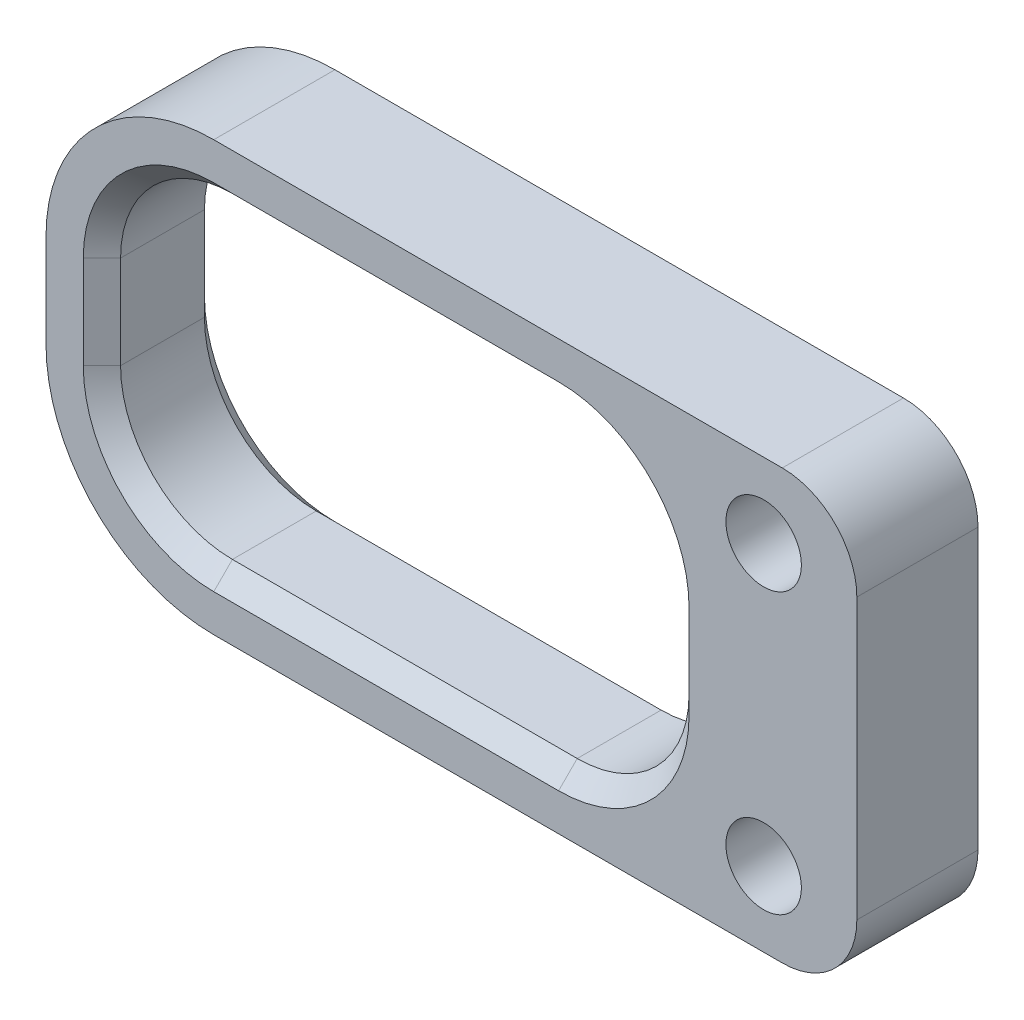
ISO-10303-21;
HEADER;
FILE_DESCRIPTION(('STEP AP214'),'2;1');
FILE_NAME('part.step','',(''),(''),'','','');
FILE_SCHEMA(('AUTOMOTIVE_DESIGN { 1 0 10303 214 1 1 1 1 }'));
ENDSEC;
DATA;
#1=APPLICATION_CONTEXT('core data for automotive mechanical design processes');
#2=APPLICATION_PROTOCOL_DEFINITION('international standard','automotive_design',2000,#1);
#3=PRODUCT_CONTEXT('',#1,'mechanical');
#4=PRODUCT('Part','Part','',(#3));
#5=PRODUCT_RELATED_PRODUCT_CATEGORY('part','',(#4));
#6=PRODUCT_DEFINITION_FORMATION('','',#4);
#7=PRODUCT_DEFINITION_CONTEXT('part definition',#1,'design');
#8=PRODUCT_DEFINITION('design','',#6,#7);
#9=PRODUCT_DEFINITION_SHAPE('','',#8);
#10=(LENGTH_UNIT() NAMED_UNIT(*) SI_UNIT(.MILLI.,.METRE.));
#11=(NAMED_UNIT(*) PLANE_ANGLE_UNIT() SI_UNIT($,.RADIAN.));
#12=(NAMED_UNIT(*) SI_UNIT($,.STERADIAN.) SOLID_ANGLE_UNIT());
#13=UNCERTAINTY_MEASURE_WITH_UNIT(LENGTH_MEASURE(1.E-05),#10,'distance_accuracy_value','');
#14=(GEOMETRIC_REPRESENTATION_CONTEXT(3) GLOBAL_UNCERTAINTY_ASSIGNED_CONTEXT((#13)) GLOBAL_UNIT_ASSIGNED_CONTEXT((#10,
#11,#12)) REPRESENTATION_CONTEXT('',''));
#15=CARTESIAN_POINT('',(0.,0.,0.));
#16=DIRECTION('',(0.,0.,1.));
#17=DIRECTION('',(1.,0.,0.));
#18=AXIS2_PLACEMENT_3D('',#15,#16,#17);
#19=CARTESIAN_POINT('',(-29.5,-5.,6.5));
#20=DIRECTION('',(0.,0.,1.));
#21=DIRECTION('',(1.,0.,0.));
#22=AXIS2_PLACEMENT_3D('',#19,#20,#21);
#23=PLANE('',#22);
#24=CARTESIAN_POINT('',(-11.,-10.,6.5));
#25=DIRECTION('',(0.,0.,1.));
#26=DIRECTION('',(1.,0.,0.));
#27=AXIS2_PLACEMENT_3D('',#24,#25,#26);
#28=CIRCLE('',#27,6.99999999999999);
#29=CARTESIAN_POINT('',(-4.,-10.,6.5));
#30=VERTEX_POINT('',#29);
#31=CARTESIAN_POINT('',(-11.,-17.,6.5));
#32=VERTEX_POINT('',#31);
#33=EDGE_CURVE('E41',#30,#32,#28,.F.);
#34=ORIENTED_EDGE('',*,*,#33,.T.);
#35=DIRECTION('',(-1.,0.,0.));
#36=VECTOR('',#35,1.);
#37=CARTESIAN_POINT('',(-29.5,-17.,6.5));
#38=LINE('',#37,#36);
#39=CARTESIAN_POINT('',(-29.5,-17.,6.5));
#40=VERTEX_POINT('',#39);
#41=EDGE_CURVE('E11',#32,#40,#38,.T.);
#42=ORIENTED_EDGE('',*,*,#41,.T.);
#43=CARTESIAN_POINT('',(-29.5,-10.,6.5));
#44=DIRECTION('',(0.,0.,1.));
#45=DIRECTION('',(1.,0.,0.));
#46=AXIS2_PLACEMENT_3D('',#43,#44,#45);
#47=CIRCLE('',#46,6.99999999999999);
#48=CARTESIAN_POINT('',(-36.5,-10.,6.5));
#49=VERTEX_POINT('',#48);
#50=EDGE_CURVE('E286',#40,#49,#47,.F.);
#51=ORIENTED_EDGE('',*,*,#50,.T.);
#52=DIRECTION('',(0.,1.,0.));
#53=VECTOR('',#52,1.);
#54=CARTESIAN_POINT('',(-36.5,-5.,6.5));
#55=LINE('',#54,#53);
#56=CARTESIAN_POINT('',(-36.5,-5.,6.5));
#57=VERTEX_POINT('',#56);
#58=EDGE_CURVE('E282',#49,#57,#55,.T.);
#59=ORIENTED_EDGE('',*,*,#58,.T.);
#60=CARTESIAN_POINT('',(-29.5,-5.,6.5));
#61=DIRECTION('',(0.,0.,1.));
#62=DIRECTION('',(1.,0.,0.));
#63=AXIS2_PLACEMENT_3D('',#60,#61,#62);
#64=CIRCLE('',#63,6.99999999999999);
#65=CARTESIAN_POINT('',(-29.5,1.99999999999999,6.5));
#66=VERTEX_POINT('',#65);
#67=EDGE_CURVE('E278',#57,#66,#64,.F.);
#68=ORIENTED_EDGE('',*,*,#67,.T.);
#69=DIRECTION('',(1.,0.,0.));
#70=VECTOR('',#69,1.);
#71=CARTESIAN_POINT('',(-29.5,1.99999999999999,6.5));
#72=LINE('',#71,#70);
#73=CARTESIAN_POINT('',(-11.,1.99999999999999,6.5));
#74=VERTEX_POINT('',#73);
#75=EDGE_CURVE('E276',#66,#74,#72,.T.);
#76=ORIENTED_EDGE('',*,*,#75,.T.);
#77=CARTESIAN_POINT('',(-11.,-5.,6.5));
#78=DIRECTION('',(0.,0.,1.));
#79=DIRECTION('',(1.,0.,0.));
#80=AXIS2_PLACEMENT_3D('',#77,#78,#79);
#81=CIRCLE('',#80,6.99999999999999);
#82=CARTESIAN_POINT('',(-4.00000000000001,-5.,6.5));
#83=VERTEX_POINT('',#82);
#84=EDGE_CURVE('E280',#74,#83,#81,.F.);
#85=ORIENTED_EDGE('',*,*,#84,.T.);
#86=DIRECTION('',(0.,-1.,0.));
#87=VECTOR('',#86,1.);
#88=CARTESIAN_POINT('',(-4.,-5.,6.5));
#89=LINE('',#88,#87);
#90=EDGE_CURVE('E284',#83,#30,#89,.T.);
#91=ORIENTED_EDGE('',*,*,#90,.T.);
#92=EDGE_LOOP('',(#34,#42,#51,#59,#68,#76,#85,#91));
#93=FACE_BOUND('',#92,.T.);
#94=CARTESIAN_POINT('',(0.,-15.,6.5));
#95=DIRECTION('',(0.,0.,1.));
#96=DIRECTION('',(1.,0.,0.));
#97=AXIS2_PLACEMENT_3D('',#94,#95,#96);
#98=CIRCLE('',#97,2.02548347896413);
#99=CARTESIAN_POINT('',(2.02548347896413,-15.,6.5));
#100=VERTEX_POINT('',#99);
#101=EDGE_CURVE('E383',#100,#100,#98,.T.);
#102=ORIENTED_EDGE('',*,*,#101,.F.);
#103=EDGE_LOOP('',(#102));
#104=FACE_BOUND('',#103,.T.);
#105=CARTESIAN_POINT('',(-29.5,-5.,6.5));
#106=DIRECTION('',(0.,0.,1.));
#107=DIRECTION('',(1.,0.,0.));
#108=AXIS2_PLACEMENT_3D('',#105,#106,#107);
#109=CIRCLE('',#108,9.);
#110=CARTESIAN_POINT('',(-29.5,4.,6.5));
#111=VERTEX_POINT('',#110);
#112=CARTESIAN_POINT('',(-38.5,-5.,6.5));
#113=VERTEX_POINT('',#112);
#114=EDGE_CURVE('E206',#111,#113,#109,.T.);
#115=ORIENTED_EDGE('',*,*,#114,.T.);
#116=DIRECTION('',(0.,-1.,0.));
#117=VECTOR('',#116,1.);
#118=CARTESIAN_POINT('',(-38.5,-5.,6.5));
#119=LINE('',#118,#117);
#120=CARTESIAN_POINT('',(-38.5,-10.,6.5));
#121=VERTEX_POINT('',#120);
#122=EDGE_CURVE('E195',#113,#121,#119,.T.);
#123=ORIENTED_EDGE('',*,*,#122,.T.);
#124=CARTESIAN_POINT('',(-29.5,-10.,6.5));
#125=DIRECTION('',(0.,0.,1.));
#126=DIRECTION('',(1.,0.,0.));
#127=AXIS2_PLACEMENT_3D('',#124,#125,#126);
#128=CIRCLE('',#127,9.);
#129=CARTESIAN_POINT('',(-29.5,-19.,6.5));
#130=VERTEX_POINT('',#129);
#131=EDGE_CURVE('E205',#121,#130,#128,.T.);
#132=ORIENTED_EDGE('',*,*,#131,.T.);
#133=DIRECTION('',(1.,0.,0.));
#134=VECTOR('',#133,1.);
#135=CARTESIAN_POINT('',(-29.5,-19.,6.5));
#136=LINE('',#135,#134);
#137=CARTESIAN_POINT('',(1.,-19.,6.5));
#138=VERTEX_POINT('',#137);
#139=EDGE_CURVE('E395',#130,#138,#136,.T.);
#140=ORIENTED_EDGE('',*,*,#139,.T.);
#141=CARTESIAN_POINT('',(1.,-15.,6.5));
#142=DIRECTION('',(0.,0.,1.));
#143=DIRECTION('',(1.,0.,0.));
#144=AXIS2_PLACEMENT_3D('',#141,#142,#143);
#145=CIRCLE('',#144,4.);
#146=CARTESIAN_POINT('',(5.,-15.,6.5));
#147=VERTEX_POINT('',#146);
#148=EDGE_CURVE('E397',#138,#147,#145,.T.);
#149=ORIENTED_EDGE('',*,*,#148,.T.);
#150=DIRECTION('',(0.,1.,0.));
#151=VECTOR('',#150,1.);
#152=CARTESIAN_POINT('',(5.,0.,6.5));
#153=LINE('',#152,#151);
#154=CARTESIAN_POINT('',(5.,0.,6.5));
#155=VERTEX_POINT('',#154);
#156=EDGE_CURVE('E399',#147,#155,#153,.T.);
#157=ORIENTED_EDGE('',*,*,#156,.T.);
#158=CARTESIAN_POINT('',(1.,0.,6.5));
#159=DIRECTION('',(0.,0.,1.));
#160=DIRECTION('',(-1.,0.,0.));
#161=AXIS2_PLACEMENT_3D('',#158,#159,#160);
#162=CIRCLE('',#161,4.);
#163=CARTESIAN_POINT('',(1.,4.,6.5));
#164=VERTEX_POINT('',#163);
#165=EDGE_CURVE('E401',#155,#164,#162,.T.);
#166=ORIENTED_EDGE('',*,*,#165,.T.);
#167=DIRECTION('',(-1.,0.,0.));
#168=VECTOR('',#167,1.);
#169=CARTESIAN_POINT('',(-29.5,4.,6.5));
#170=LINE('',#169,#168);
#171=EDGE_CURVE('E211',#164,#111,#170,.T.);
#172=ORIENTED_EDGE('',*,*,#171,.T.);
#173=EDGE_LOOP('',(#115,#123,#132,#140,#149,#157,#166,#172));
#174=FACE_BOUND('',#173,.T.);
#175=CARTESIAN_POINT('',(0.,0.,6.5));
#176=DIRECTION('',(0.,0.,1.));
#177=DIRECTION('',(1.,0.,0.));
#178=AXIS2_PLACEMENT_3D('',#175,#176,#177);
#179=CIRCLE('',#178,2.02548347896413);
#180=CARTESIAN_POINT('',(2.02548347896413,0.,6.5));
#181=VERTEX_POINT('',#180);
#182=EDGE_CURVE('E389',#181,#181,#179,.T.);
#183=ORIENTED_EDGE('',*,*,#182,.F.);
#184=EDGE_LOOP('',(#183));
#185=FACE_BOUND('',#184,.T.);
#186=ADVANCED_FACE('F32',(#93,#104,#174,#185),#23,.T.);
#187=CARTESIAN_POINT('',(-29.5,-5.,0.));
#188=DIRECTION('',(0.,0.,1.));
#189=DIRECTION('',(1.,0.,0.));
#190=AXIS2_PLACEMENT_3D('',#187,#188,#189);
#191=PLANE('',#190);
#192=CARTESIAN_POINT('',(-11.,-5.,0.));
#193=DIRECTION('',(0.,0.,1.));
#194=DIRECTION('',(1.,0.,0.));
#195=AXIS2_PLACEMENT_3D('',#192,#193,#194);
#196=CIRCLE('',#195,7.);
#197=CARTESIAN_POINT('',(-4.,-5.,0.));
#198=VERTEX_POINT('',#197);
#199=CARTESIAN_POINT('',(-11.,2.,0.));
#200=VERTEX_POINT('',#199);
#201=EDGE_CURVE('E235',#198,#200,#196,.T.);
#202=ORIENTED_EDGE('',*,*,#201,.T.);
#203=DIRECTION('',(-1.,0.,0.));
#204=VECTOR('',#203,1.);
#205=CARTESIAN_POINT('',(-29.5,2.,0.));
#206=LINE('',#205,#204);
#207=CARTESIAN_POINT('',(-29.5,2.,0.));
#208=VERTEX_POINT('',#207);
#209=EDGE_CURVE('E239',#200,#208,#206,.T.);
#210=ORIENTED_EDGE('',*,*,#209,.T.);
#211=CARTESIAN_POINT('',(-29.5,-5.,0.));
#212=DIRECTION('',(0.,0.,1.));
#213=DIRECTION('',(1.,0.,0.));
#214=AXIS2_PLACEMENT_3D('',#211,#212,#213);
#215=CIRCLE('',#214,7.);
#216=CARTESIAN_POINT('',(-36.5,-5.,0.));
#217=VERTEX_POINT('',#216);
#218=EDGE_CURVE('E237',#208,#217,#215,.T.);
#219=ORIENTED_EDGE('',*,*,#218,.T.);
#220=DIRECTION('',(0.,-1.,0.));
#221=VECTOR('',#220,1.);
#222=CARTESIAN_POINT('',(-36.5,-10.,0.));
#223=LINE('',#222,#221);
#224=CARTESIAN_POINT('',(-36.5,-10.,0.));
#225=VERTEX_POINT('',#224);
#226=EDGE_CURVE('E233',#217,#225,#223,.T.);
#227=ORIENTED_EDGE('',*,*,#226,.T.);
#228=CARTESIAN_POINT('',(-29.5,-10.,0.));
#229=DIRECTION('',(0.,0.,1.));
#230=DIRECTION('',(1.,0.,0.));
#231=AXIS2_PLACEMENT_3D('',#228,#229,#230);
#232=CIRCLE('',#231,7.);
#233=CARTESIAN_POINT('',(-29.5,-17.,0.));
#234=VERTEX_POINT('',#233);
#235=EDGE_CURVE('E229',#225,#234,#232,.T.);
#236=ORIENTED_EDGE('',*,*,#235,.T.);
#237=DIRECTION('',(1.,0.,0.));
#238=VECTOR('',#237,1.);
#239=CARTESIAN_POINT('',(-11.,-17.,0.));
#240=LINE('',#239,#238);
#241=CARTESIAN_POINT('',(-11.,-17.,0.));
#242=VERTEX_POINT('',#241);
#243=EDGE_CURVE('E220',#234,#242,#240,.T.);
#244=ORIENTED_EDGE('',*,*,#243,.T.);
#245=CARTESIAN_POINT('',(-11.,-10.,0.));
#246=DIRECTION('',(0.,0.,1.));
#247=DIRECTION('',(1.,0.,0.));
#248=AXIS2_PLACEMENT_3D('',#245,#246,#247);
#249=CIRCLE('',#248,7.);
#250=CARTESIAN_POINT('',(-4.,-10.,0.));
#251=VERTEX_POINT('',#250);
#252=EDGE_CURVE('E222',#242,#251,#249,.T.);
#253=ORIENTED_EDGE('',*,*,#252,.T.);
#254=DIRECTION('',(0.,1.,0.));
#255=VECTOR('',#254,1.);
#256=CARTESIAN_POINT('',(-4.,-5.,0.));
#257=LINE('',#256,#255);
#258=EDGE_CURVE('E231',#251,#198,#257,.T.);
#259=ORIENTED_EDGE('',*,*,#258,.T.);
#260=EDGE_LOOP('',(#202,#210,#219,#227,#236,#244,#253,#259));
#261=FACE_BOUND('',#260,.T.);
#262=CARTESIAN_POINT('',(0.,-15.,0.));
#263=DIRECTION('',(0.,0.,1.));
#264=DIRECTION('',(1.,0.,0.));
#265=AXIS2_PLACEMENT_3D('',#262,#263,#264);
#266=CIRCLE('',#265,2.02548347896413);
#267=CARTESIAN_POINT('',(2.02548347896413,-15.,0.));
#268=VERTEX_POINT('',#267);
#269=EDGE_CURVE('E382',#268,#268,#266,.T.);
#270=ORIENTED_EDGE('',*,*,#269,.T.);
#271=EDGE_LOOP('',(#270));
#272=FACE_BOUND('',#271,.T.);
#273=CARTESIAN_POINT('',(-29.5,-5.,0.));
#274=DIRECTION('',(0.,0.,1.));
#275=DIRECTION('',(1.,0.,0.));
#276=AXIS2_PLACEMENT_3D('',#273,#274,#275);
#277=CIRCLE('',#276,9.);
#278=CARTESIAN_POINT('',(-29.5,4.,0.));
#279=VERTEX_POINT('',#278);
#280=CARTESIAN_POINT('',(-38.5,-5.,0.));
#281=VERTEX_POINT('',#280);
#282=EDGE_CURVE('E219',#279,#281,#277,.T.);
#283=ORIENTED_EDGE('',*,*,#282,.F.);
#284=DIRECTION('',(-1.,0.,0.));
#285=VECTOR('',#284,1.);
#286=CARTESIAN_POINT('',(-29.5,4.,0.));
#287=LINE('',#286,#285);
#288=CARTESIAN_POINT('',(1.,4.,0.));
#289=VERTEX_POINT('',#288);
#290=EDGE_CURVE('E215',#289,#279,#287,.T.);
#291=ORIENTED_EDGE('',*,*,#290,.F.);
#292=CARTESIAN_POINT('',(1.,0.,0.));
#293=DIRECTION('',(0.,0.,1.));
#294=DIRECTION('',(-1.,0.,0.));
#295=AXIS2_PLACEMENT_3D('',#292,#293,#294);
#296=CIRCLE('',#295,4.);
#297=CARTESIAN_POINT('',(5.,0.,0.));
#298=VERTEX_POINT('',#297);
#299=EDGE_CURVE('E416',#298,#289,#296,.T.);
#300=ORIENTED_EDGE('',*,*,#299,.F.);
#301=DIRECTION('',(0.,1.,0.));
#302=VECTOR('',#301,1.);
#303=CARTESIAN_POINT('',(5.,0.,0.));
#304=LINE('',#303,#302);
#305=CARTESIAN_POINT('',(5.,-15.,0.));
#306=VERTEX_POINT('',#305);
#307=EDGE_CURVE('E414',#306,#298,#304,.T.);
#308=ORIENTED_EDGE('',*,*,#307,.F.);
#309=CARTESIAN_POINT('',(1.,-15.,0.));
#310=DIRECTION('',(0.,0.,1.));
#311=DIRECTION('',(1.,0.,0.));
#312=AXIS2_PLACEMENT_3D('',#309,#310,#311);
#313=CIRCLE('',#312,4.);
#314=CARTESIAN_POINT('',(1.,-19.,0.));
#315=VERTEX_POINT('',#314);
#316=EDGE_CURVE('E412',#315,#306,#313,.T.);
#317=ORIENTED_EDGE('',*,*,#316,.F.);
#318=DIRECTION('',(1.,0.,0.));
#319=VECTOR('',#318,1.);
#320=CARTESIAN_POINT('',(-29.5,-19.,0.));
#321=LINE('',#320,#319);
#322=CARTESIAN_POINT('',(-29.5,-19.,0.));
#323=VERTEX_POINT('',#322);
#324=EDGE_CURVE('E410',#323,#315,#321,.T.);
#325=ORIENTED_EDGE('',*,*,#324,.F.);
#326=CARTESIAN_POINT('',(-29.5,-10.,0.));
#327=DIRECTION('',(0.,0.,1.));
#328=DIRECTION('',(1.,0.,0.));
#329=AXIS2_PLACEMENT_3D('',#326,#327,#328);
#330=CIRCLE('',#329,9.);
#331=CARTESIAN_POINT('',(-38.5,-10.,0.));
#332=VERTEX_POINT('',#331);
#333=EDGE_CURVE('E408',#332,#323,#330,.T.);
#334=ORIENTED_EDGE('',*,*,#333,.F.);
#335=DIRECTION('',(0.,-1.,0.));
#336=VECTOR('',#335,1.);
#337=CARTESIAN_POINT('',(-38.5,-5.,0.));
#338=LINE('',#337,#336);
#339=EDGE_CURVE('E406',#281,#332,#338,.T.);
#340=ORIENTED_EDGE('',*,*,#339,.F.);
#341=EDGE_LOOP('',(#283,#291,#300,#308,#317,#325,#334,#340));
#342=FACE_BOUND('',#341,.T.);
#343=CARTESIAN_POINT('',(0.,0.,0.));
#344=DIRECTION('',(0.,0.,1.));
#345=DIRECTION('',(1.,0.,0.));
#346=AXIS2_PLACEMENT_3D('',#343,#344,#345);
#347=CIRCLE('',#346,2.02548347896413);
#348=CARTESIAN_POINT('',(2.02548347896413,0.,0.));
#349=VERTEX_POINT('',#348);
#350=EDGE_CURVE('E386',#349,#349,#347,.T.);
#351=ORIENTED_EDGE('',*,*,#350,.T.);
#352=EDGE_LOOP('',(#351));
#353=FACE_BOUND('',#352,.T.);
#354=ADVANCED_FACE('F442',(#261,#272,#342,#353),#191,.F.);
#355=CARTESIAN_POINT('',(-29.5,-5.,6.5));
#356=DIRECTION('',(0.,0.,-1.));
#357=DIRECTION('',(-1.,0.,0.));
#358=AXIS2_PLACEMENT_3D('',#355,#356,#357);
#359=CYLINDRICAL_SURFACE('',#358,9.);
#360=ORIENTED_EDGE('',*,*,#282,.T.);
#361=DIRECTION('',(0.,0.,-1.));
#362=VECTOR('',#361,1.);
#363=CARTESIAN_POINT('',(-38.5,-5.,6.5));
#364=LINE('',#363,#362);
#365=EDGE_CURVE('E199',#113,#281,#364,.T.);
#366=ORIENTED_EDGE('',*,*,#365,.F.);
#367=ORIENTED_EDGE('',*,*,#114,.F.);
#368=DIRECTION('',(0.,0.,-1.));
#369=VECTOR('',#368,1.);
#370=CARTESIAN_POINT('',(-29.5,4.,6.5));
#371=LINE('',#370,#369);
#372=EDGE_CURVE('E404',#111,#279,#371,.T.);
#373=ORIENTED_EDGE('',*,*,#372,.T.);
#374=EDGE_LOOP('',(#360,#366,#367,#373));
#375=FACE_BOUND('',#374,.T.);
#376=ADVANCED_FACE('F217',(#375),#359,.T.);
#377=CARTESIAN_POINT('',(-38.5,-5.,6.5));
#378=DIRECTION('',(1.,0.,0.));
#379=DIRECTION('',(0.,0.,-1.));
#380=AXIS2_PLACEMENT_3D('',#377,#378,#379);
#381=PLANE('',#380);
#382=ORIENTED_EDGE('',*,*,#339,.T.);
#383=DIRECTION('',(0.,0.,-1.));
#384=VECTOR('',#383,1.);
#385=CARTESIAN_POINT('',(-38.5,-10.,6.5));
#386=LINE('',#385,#384);
#387=EDGE_CURVE('E202',#121,#332,#386,.T.);
#388=ORIENTED_EDGE('',*,*,#387,.F.);
#389=ORIENTED_EDGE('',*,*,#122,.F.);
#390=ORIENTED_EDGE('',*,*,#365,.T.);
#391=EDGE_LOOP('',(#382,#388,#389,#390));
#392=FACE_BOUND('',#391,.T.);
#393=ADVANCED_FACE('F197',(#392),#381,.F.);
#394=CARTESIAN_POINT('',(-29.5,-10.,6.5));
#395=DIRECTION('',(0.,0.,-1.));
#396=DIRECTION('',(-1.,0.,0.));
#397=AXIS2_PLACEMENT_3D('',#394,#395,#396);
#398=CYLINDRICAL_SURFACE('',#397,9.);
#399=ORIENTED_EDGE('',*,*,#333,.T.);
#400=DIRECTION('',(0.,0.,-1.));
#401=VECTOR('',#400,1.);
#402=CARTESIAN_POINT('',(-29.5,-19.,6.5));
#403=LINE('',#402,#401);
#404=EDGE_CURVE('E224',#130,#323,#403,.T.);
#405=ORIENTED_EDGE('',*,*,#404,.F.);
#406=ORIENTED_EDGE('',*,*,#131,.F.);
#407=ORIENTED_EDGE('',*,*,#387,.T.);
#408=EDGE_LOOP('',(#399,#405,#406,#407));
#409=FACE_BOUND('',#408,.T.);
#410=ADVANCED_FACE('F456',(#409),#398,.T.);
#411=CARTESIAN_POINT('',(-29.5,-19.,6.5));
#412=DIRECTION('',(0.,1.,0.));
#413=DIRECTION('',(0.,0.,1.));
#414=AXIS2_PLACEMENT_3D('',#411,#412,#413);
#415=PLANE('',#414);
#416=ORIENTED_EDGE('',*,*,#324,.T.);
#417=DIRECTION('',(0.,0.,-1.));
#418=VECTOR('',#417,1.);
#419=CARTESIAN_POINT('',(1.,-19.,6.5));
#420=LINE('',#419,#418);
#421=EDGE_CURVE('E429',#138,#315,#420,.T.);
#422=ORIENTED_EDGE('',*,*,#421,.F.);
#423=ORIENTED_EDGE('',*,*,#139,.F.);
#424=ORIENTED_EDGE('',*,*,#404,.T.);
#425=EDGE_LOOP('',(#416,#422,#423,#424));
#426=FACE_BOUND('',#425,.T.);
#427=ADVANCED_FACE('F436',(#426),#415,.F.);
#428=CARTESIAN_POINT('',(1.,-15.,6.5));
#429=DIRECTION('',(0.,0.,-1.));
#430=DIRECTION('',(-1.,0.,0.));
#431=AXIS2_PLACEMENT_3D('',#428,#429,#430);
#432=CYLINDRICAL_SURFACE('',#431,4.);
#433=ORIENTED_EDGE('',*,*,#316,.T.);
#434=DIRECTION('',(0.,0.,-1.));
#435=VECTOR('',#434,1.);
#436=CARTESIAN_POINT('',(5.,-15.,6.5));
#437=LINE('',#436,#435);
#438=EDGE_CURVE('E426',#147,#306,#437,.T.);
#439=ORIENTED_EDGE('',*,*,#438,.F.);
#440=ORIENTED_EDGE('',*,*,#148,.F.);
#441=ORIENTED_EDGE('',*,*,#421,.T.);
#442=EDGE_LOOP('',(#433,#439,#440,#441));
#443=FACE_BOUND('',#442,.T.);
#444=ADVANCED_FACE('F448',(#443),#432,.T.);
#445=CARTESIAN_POINT('',(5.,0.,6.5));
#446=DIRECTION('',(-1.,0.,0.));
#447=DIRECTION('',(0.,0.,1.));
#448=AXIS2_PLACEMENT_3D('',#445,#446,#447);
#449=PLANE('',#448);
#450=ORIENTED_EDGE('',*,*,#307,.T.);
#451=DIRECTION('',(0.,0.,-1.));
#452=VECTOR('',#451,1.);
#453=CARTESIAN_POINT('',(5.,0.,6.5));
#454=LINE('',#453,#452);
#455=EDGE_CURVE('E423',#155,#298,#454,.T.);
#456=ORIENTED_EDGE('',*,*,#455,.F.);
#457=ORIENTED_EDGE('',*,*,#156,.F.);
#458=ORIENTED_EDGE('',*,*,#438,.T.);
#459=EDGE_LOOP('',(#450,#456,#457,#458));
#460=FACE_BOUND('',#459,.T.);
#461=ADVANCED_FACE('F452',(#460),#449,.F.);
#462=CARTESIAN_POINT('',(1.,0.,6.5));
#463=DIRECTION('',(0.,0.,-1.));
#464=DIRECTION('',(-1.,0.,0.));
#465=AXIS2_PLACEMENT_3D('',#462,#463,#464);
#466=CYLINDRICAL_SURFACE('',#465,4.);
#467=ORIENTED_EDGE('',*,*,#299,.T.);
#468=DIRECTION('',(0.,0.,-1.));
#469=VECTOR('',#468,1.);
#470=CARTESIAN_POINT('',(1.,4.,6.5));
#471=LINE('',#470,#469);
#472=EDGE_CURVE('E420',#164,#289,#471,.T.);
#473=ORIENTED_EDGE('',*,*,#472,.F.);
#474=ORIENTED_EDGE('',*,*,#165,.F.);
#475=ORIENTED_EDGE('',*,*,#455,.T.);
#476=EDGE_LOOP('',(#467,#473,#474,#475));
#477=FACE_BOUND('',#476,.T.);
#478=ADVANCED_FACE('F479',(#477),#466,.T.);
#479=CARTESIAN_POINT('',(-29.5,4.,6.5));
#480=DIRECTION('',(0.,-1.,0.));
#481=DIRECTION('',(0.,0.,-1.));
#482=AXIS2_PLACEMENT_3D('',#479,#480,#481);
#483=PLANE('',#482);
#484=ORIENTED_EDGE('',*,*,#290,.T.);
#485=ORIENTED_EDGE('',*,*,#372,.F.);
#486=ORIENTED_EDGE('',*,*,#171,.F.);
#487=ORIENTED_EDGE('',*,*,#472,.T.);
#488=EDGE_LOOP('',(#484,#485,#486,#487));
#489=FACE_BOUND('',#488,.T.);
#490=ADVANCED_FACE('F476',(#489),#483,.F.);
#491=CARTESIAN_POINT('',(0.,0.,6.5));
#492=DIRECTION('',(0.,0.,-1.));
#493=DIRECTION('',(-1.,0.,0.));
#494=AXIS2_PLACEMENT_3D('',#491,#492,#493);
#495=CYLINDRICAL_SURFACE('',#494,2.02548347896413);
#496=ORIENTED_EDGE('',*,*,#182,.T.);
#497=EDGE_LOOP('',(#496));
#498=FACE_BOUND('',#497,.T.);
#499=ORIENTED_EDGE('',*,*,#350,.F.);
#500=EDGE_LOOP('',(#499));
#501=FACE_BOUND('',#500,.T.);
#502=ADVANCED_FACE('F473',(#498,#501),#495,.F.);
#503=CARTESIAN_POINT('',(0.,-15.,6.5));
#504=DIRECTION('',(0.,0.,-1.));
#505=DIRECTION('',(-1.,0.,0.));
#506=AXIS2_PLACEMENT_3D('',#503,#504,#505);
#507=CYLINDRICAL_SURFACE('',#506,2.02548347896413);
#508=ORIENTED_EDGE('',*,*,#101,.T.);
#509=EDGE_LOOP('',(#508));
#510=FACE_BOUND('',#509,.T.);
#511=ORIENTED_EDGE('',*,*,#269,.F.);
#512=EDGE_LOOP('',(#511));
#513=FACE_BOUND('',#512,.T.);
#514=ADVANCED_FACE('F509',(#510,#513),#507,.F.);
#515=CARTESIAN_POINT('',(-11.,-5.,6.5));
#516=DIRECTION('',(0.,0.,-1.));
#517=DIRECTION('',(-1.,0.,0.));
#518=AXIS2_PLACEMENT_3D('',#515,#516,#517);
#519=CYLINDRICAL_SURFACE('',#518,6.);
#520=DIRECTION('',(0.,0.,-1.));
#521=VECTOR('',#520,1.);
#522=CARTESIAN_POINT('',(-11.,1.,6.5));
#523=LINE('',#522,#521);
#524=CARTESIAN_POINT('',(-11.,1.,5.50000000000001));
#525=VERTEX_POINT('',#524);
#526=CARTESIAN_POINT('',(-11.,1.,1.00000000000001));
#527=VERTEX_POINT('',#526);
#528=EDGE_CURVE('E379',#525,#527,#523,.T.);
#529=ORIENTED_EDGE('',*,*,#528,.T.);
#530=CARTESIAN_POINT('',(-11.,-5.,1.00000000000001));
#531=DIRECTION('',(0.,0.,1.));
#532=DIRECTION('',(1.,0.,0.));
#533=AXIS2_PLACEMENT_3D('',#530,#531,#532);
#534=CIRCLE('',#533,6.);
#535=CARTESIAN_POINT('',(-5.,-5.,1.00000000000001));
#536=VERTEX_POINT('',#535);
#537=EDGE_CURVE('E253',#527,#536,#534,.F.);
#538=ORIENTED_EDGE('',*,*,#537,.T.);
#539=DIRECTION('',(0.,0.,-1.));
#540=VECTOR('',#539,1.);
#541=CARTESIAN_POINT('',(-5.,-5.,6.5));
#542=LINE('',#541,#540);
#543=CARTESIAN_POINT('',(-5.,-5.,5.50000000000001));
#544=VERTEX_POINT('',#543);
#545=EDGE_CURVE('E311',#544,#536,#542,.T.);
#546=ORIENTED_EDGE('',*,*,#545,.F.);
#547=CARTESIAN_POINT('',(-11.,-5.,5.50000000000001));
#548=DIRECTION('',(0.,0.,1.));
#549=DIRECTION('',(1.,0.,0.));
#550=AXIS2_PLACEMENT_3D('',#547,#548,#549);
#551=CIRCLE('',#550,6.);
#552=EDGE_CURVE('E251',#544,#525,#551,.T.);
#553=ORIENTED_EDGE('',*,*,#552,.T.);
#554=EDGE_LOOP('',(#529,#538,#546,#553));
#555=FACE_BOUND('',#554,.T.);
#556=ADVANCED_FACE('F516',(#555),#519,.F.);
#557=CARTESIAN_POINT('',(-29.5,1.,6.5));
#558=DIRECTION('',(0.,-1.,0.));
#559=DIRECTION('',(0.,0.,-1.));
#560=AXIS2_PLACEMENT_3D('',#557,#558,#559);
#561=PLANE('',#560);
#562=DIRECTION('',(0.,0.,-1.));
#563=VECTOR('',#562,1.);
#564=CARTESIAN_POINT('',(-29.5,1.,6.5));
#565=LINE('',#564,#563);
#566=CARTESIAN_POINT('',(-29.5,1.,5.50000000000001));
#567=VERTEX_POINT('',#566);
#568=CARTESIAN_POINT('',(-29.5,1.,1.00000000000001));
#569=VERTEX_POINT('',#568);
#570=EDGE_CURVE('E376',#567,#569,#565,.T.);
#571=ORIENTED_EDGE('',*,*,#570,.T.);
#572=DIRECTION('',(1.,0.,0.));
#573=VECTOR('',#572,1.);
#574=CARTESIAN_POINT('',(-11.,1.,1.00000000000001));
#575=LINE('',#574,#573);
#576=EDGE_CURVE('E244',#569,#527,#575,.T.);
#577=ORIENTED_EDGE('',*,*,#576,.T.);
#578=ORIENTED_EDGE('',*,*,#528,.F.);
#579=DIRECTION('',(-1.,0.,0.));
#580=VECTOR('',#579,1.);
#581=CARTESIAN_POINT('',(-29.5,1.,5.50000000000001));
#582=LINE('',#581,#580);
#583=EDGE_CURVE('E242',#525,#567,#582,.T.);
#584=ORIENTED_EDGE('',*,*,#583,.T.);
#585=EDGE_LOOP('',(#571,#577,#578,#584));
#586=FACE_BOUND('',#585,.T.);
#587=ADVANCED_FACE('F523',(#586),#561,.T.);
#588=CARTESIAN_POINT('',(-29.5,-5.,6.5));
#589=DIRECTION('',(0.,0.,-1.));
#590=DIRECTION('',(-1.,0.,0.));
#591=AXIS2_PLACEMENT_3D('',#588,#589,#590);
#592=CYLINDRICAL_SURFACE('',#591,6.);
#593=DIRECTION('',(0.,0.,-1.));
#594=VECTOR('',#593,1.);
#595=CARTESIAN_POINT('',(-35.5,-5.,6.5));
#596=LINE('',#595,#594);
#597=CARTESIAN_POINT('',(-35.5,-5.,5.50000000000001));
#598=VERTEX_POINT('',#597);
#599=CARTESIAN_POINT('',(-35.5,-5.,1.00000000000001));
#600=VERTEX_POINT('',#599);
#601=EDGE_CURVE('E368',#598,#600,#596,.T.);
#602=ORIENTED_EDGE('',*,*,#601,.T.);
#603=CARTESIAN_POINT('',(-29.5,-5.,1.00000000000001));
#604=DIRECTION('',(0.,0.,1.));
#605=DIRECTION('',(1.,0.,0.));
#606=AXIS2_PLACEMENT_3D('',#603,#604,#605);
#607=CIRCLE('',#606,6.);
#608=EDGE_CURVE('E249',#600,#569,#607,.F.);
#609=ORIENTED_EDGE('',*,*,#608,.T.);
#610=ORIENTED_EDGE('',*,*,#570,.F.);
#611=CARTESIAN_POINT('',(-29.5,-5.,5.50000000000001));
#612=DIRECTION('',(0.,0.,1.));
#613=DIRECTION('',(1.,0.,0.));
#614=AXIS2_PLACEMENT_3D('',#611,#612,#613);
#615=CIRCLE('',#614,6.);
#616=EDGE_CURVE('E247',#567,#598,#615,.T.);
#617=ORIENTED_EDGE('',*,*,#616,.T.);
#618=EDGE_LOOP('',(#602,#609,#610,#617));
#619=FACE_BOUND('',#618,.T.);
#620=ADVANCED_FACE('F532',(#619),#592,.F.);
#621=CARTESIAN_POINT('',(-35.5,-5.,6.5));
#622=DIRECTION('',(1.,0.,0.));
#623=DIRECTION('',(0.,0.,-1.));
#624=AXIS2_PLACEMENT_3D('',#621,#622,#623);
#625=PLANE('',#624);
#626=DIRECTION('',(0.,0.,-1.));
#627=VECTOR('',#626,1.);
#628=CARTESIAN_POINT('',(-35.5,-10.,6.5));
#629=LINE('',#628,#627);
#630=CARTESIAN_POINT('',(-35.5,-10.,5.50000000000001));
#631=VERTEX_POINT('',#630);
#632=CARTESIAN_POINT('',(-35.5,-10.,1.00000000000001));
#633=VERTEX_POINT('',#632);
#634=EDGE_CURVE('E360',#631,#633,#629,.T.);
#635=ORIENTED_EDGE('',*,*,#634,.T.);
#636=DIRECTION('',(0.,1.,0.));
#637=VECTOR('',#636,1.);
#638=CARTESIAN_POINT('',(-35.5,-5.,1.00000000000001));
#639=LINE('',#638,#637);
#640=EDGE_CURVE('E257',#633,#600,#639,.T.);
#641=ORIENTED_EDGE('',*,*,#640,.T.);
#642=ORIENTED_EDGE('',*,*,#601,.F.);
#643=DIRECTION('',(0.,-1.,0.));
#644=VECTOR('',#643,1.);
#645=CARTESIAN_POINT('',(-35.5,-5.,5.50000000000001));
#646=LINE('',#645,#644);
#647=EDGE_CURVE('E255',#598,#631,#646,.T.);
#648=ORIENTED_EDGE('',*,*,#647,.T.);
#649=EDGE_LOOP('',(#635,#641,#642,#648));
#650=FACE_BOUND('',#649,.T.);
#651=ADVANCED_FACE('F540',(#650),#625,.T.);
#652=CARTESIAN_POINT('',(-29.5,-10.,6.5));
#653=DIRECTION('',(0.,0.,-1.));
#654=DIRECTION('',(-1.,0.,0.));
#655=AXIS2_PLACEMENT_3D('',#652,#653,#654);
#656=CYLINDRICAL_SURFACE('',#655,6.);
#657=DIRECTION('',(0.,0.,-1.));
#658=VECTOR('',#657,1.);
#659=CARTESIAN_POINT('',(-29.5,-16.,6.5));
#660=LINE('',#659,#658);
#661=CARTESIAN_POINT('',(-29.5,-16.,5.50000000000001));
#662=VERTEX_POINT('',#661);
#663=CARTESIAN_POINT('',(-29.5,-16.,1.00000000000001));
#664=VERTEX_POINT('',#663);
#665=EDGE_CURVE('E357',#662,#664,#660,.T.);
#666=ORIENTED_EDGE('',*,*,#665,.T.);
#667=CARTESIAN_POINT('',(-29.5,-10.,1.00000000000001));
#668=DIRECTION('',(0.,0.,1.));
#669=DIRECTION('',(1.,0.,0.));
#670=AXIS2_PLACEMENT_3D('',#667,#668,#669);
#671=CIRCLE('',#670,6.);
#672=EDGE_CURVE('E265',#664,#633,#671,.F.);
#673=ORIENTED_EDGE('',*,*,#672,.T.);
#674=ORIENTED_EDGE('',*,*,#634,.F.);
#675=CARTESIAN_POINT('',(-29.5,-10.,5.50000000000001));
#676=DIRECTION('',(0.,0.,1.));
#677=DIRECTION('',(1.,0.,0.));
#678=AXIS2_PLACEMENT_3D('',#675,#676,#677);
#679=CIRCLE('',#678,6.);
#680=EDGE_CURVE('E263',#631,#662,#679,.T.);
#681=ORIENTED_EDGE('',*,*,#680,.T.);
#682=EDGE_LOOP('',(#666,#673,#674,#681));
#683=FACE_BOUND('',#682,.T.);
#684=ADVANCED_FACE('F356',(#683),#656,.F.);
#685=CARTESIAN_POINT('',(-29.5,-16.,6.5));
#686=DIRECTION('',(0.,1.,0.));
#687=DIRECTION('',(0.,0.,1.));
#688=AXIS2_PLACEMENT_3D('',#685,#686,#687);
#689=PLANE('',#688);
#690=DIRECTION('',(0.,0.,-1.));
#691=VECTOR('',#690,1.);
#692=CARTESIAN_POINT('',(-11.,-16.,6.5));
#693=LINE('',#692,#691);
#694=CARTESIAN_POINT('',(-11.,-16.,5.50000000000001));
#695=VERTEX_POINT('',#694);
#696=CARTESIAN_POINT('',(-11.,-16.,1.00000000000001));
#697=VERTEX_POINT('',#696);
#698=EDGE_CURVE('E366',#695,#697,#693,.T.);
#699=ORIENTED_EDGE('',*,*,#698,.T.);
#700=DIRECTION('',(-1.,0.,0.));
#701=VECTOR('',#700,1.);
#702=CARTESIAN_POINT('',(-29.5,-16.,1.00000000000001));
#703=LINE('',#702,#701);
#704=EDGE_CURVE('E274',#697,#664,#703,.T.);
#705=ORIENTED_EDGE('',*,*,#704,.T.);
#706=ORIENTED_EDGE('',*,*,#665,.F.);
#707=DIRECTION('',(1.,0.,0.));
#708=VECTOR('',#707,1.);
#709=CARTESIAN_POINT('',(-29.5,-16.,5.50000000000001));
#710=LINE('',#709,#708);
#711=EDGE_CURVE('E271',#662,#695,#710,.T.);
#712=ORIENTED_EDGE('',*,*,#711,.T.);
#713=EDGE_LOOP('',(#699,#705,#706,#712));
#714=FACE_BOUND('',#713,.T.);
#715=ADVANCED_FACE('F363',(#714),#689,.T.);
#716=CARTESIAN_POINT('',(-11.,-10.,6.5));
#717=DIRECTION('',(0.,0.,-1.));
#718=DIRECTION('',(-1.,0.,0.));
#719=AXIS2_PLACEMENT_3D('',#716,#717,#718);
#720=CYLINDRICAL_SURFACE('',#719,6.);
#721=DIRECTION('',(0.,0.,-1.));
#722=VECTOR('',#721,1.);
#723=CARTESIAN_POINT('',(-5.,-10.,6.5));
#724=LINE('',#723,#722);
#725=CARTESIAN_POINT('',(-5.,-10.,5.50000000000001));
#726=VERTEX_POINT('',#725);
#727=CARTESIAN_POINT('',(-5.,-10.,1.00000000000001));
#728=VERTEX_POINT('',#727);
#729=EDGE_CURVE('E370',#726,#728,#724,.T.);
#730=ORIENTED_EDGE('',*,*,#729,.T.);
#731=CARTESIAN_POINT('',(-11.,-10.,1.00000000000001));
#732=DIRECTION('',(0.,0.,1.));
#733=DIRECTION('',(1.,0.,0.));
#734=AXIS2_PLACEMENT_3D('',#731,#732,#733);
#735=CIRCLE('',#734,6.);
#736=EDGE_CURVE('E269',#728,#697,#735,.F.);
#737=ORIENTED_EDGE('',*,*,#736,.T.);
#738=ORIENTED_EDGE('',*,*,#698,.F.);
#739=CARTESIAN_POINT('',(-11.,-10.,5.50000000000001));
#740=DIRECTION('',(0.,0.,1.));
#741=DIRECTION('',(1.,0.,0.));
#742=AXIS2_PLACEMENT_3D('',#739,#740,#741);
#743=CIRCLE('',#742,6.);
#744=EDGE_CURVE('E267',#695,#726,#743,.T.);
#745=ORIENTED_EDGE('',*,*,#744,.T.);
#746=EDGE_LOOP('',(#730,#737,#738,#745));
#747=FACE_BOUND('',#746,.T.);
#748=ADVANCED_FACE('F561',(#747),#720,.F.);
#749=CARTESIAN_POINT('',(-5.,-5.,6.5));
#750=DIRECTION('',(-1.,0.,0.));
#751=DIRECTION('',(0.,0.,1.));
#752=AXIS2_PLACEMENT_3D('',#749,#750,#751);
#753=PLANE('',#752);
#754=ORIENTED_EDGE('',*,*,#545,.T.);
#755=DIRECTION('',(0.,-1.,0.));
#756=VECTOR('',#755,1.);
#757=CARTESIAN_POINT('',(-5.,-10.,1.00000000000001));
#758=LINE('',#757,#756);
#759=EDGE_CURVE('E261',#536,#728,#758,.T.);
#760=ORIENTED_EDGE('',*,*,#759,.T.);
#761=ORIENTED_EDGE('',*,*,#729,.F.);
#762=DIRECTION('',(0.,1.,0.));
#763=VECTOR('',#762,1.);
#764=CARTESIAN_POINT('',(-5.,-5.,5.50000000000001));
#765=LINE('',#764,#763);
#766=EDGE_CURVE('E259',#726,#544,#765,.T.);
#767=ORIENTED_EDGE('',*,*,#766,.T.);
#768=EDGE_LOOP('',(#754,#760,#761,#767));
#769=FACE_BOUND('',#768,.T.);
#770=ADVANCED_FACE('F568',(#769),#753,.T.);
#771=CARTESIAN_POINT('',(-29.5,-17.,0.));
#772=DIRECTION('',(0.,0.70710678118655,-0.707106781186545));
#773=DIRECTION('',(0.,0.707106781186545,0.70710678118655));
#774=AXIS2_PLACEMENT_3D('',#771,#772,#773);
#775=PLANE('',#774);
#776=DIRECTION('',(0.,-0.707106781186545,-0.70710678118655));
#777=VECTOR('',#776,1.);
#778=CARTESIAN_POINT('',(-29.5,-16.,1.00000000000001));
#779=LINE('',#778,#777);
#780=EDGE_CURVE('E305',#664,#234,#779,.T.);
#781=ORIENTED_EDGE('',*,*,#780,.F.);
#782=ORIENTED_EDGE('',*,*,#704,.F.);
#783=DIRECTION('',(0.,0.707106781186545,0.70710678118655));
#784=VECTOR('',#783,1.);
#785=CARTESIAN_POINT('',(-11.,-17.,0.));
#786=LINE('',#785,#784);
#787=EDGE_CURVE('E308',#242,#697,#786,.T.);
#788=ORIENTED_EDGE('',*,*,#787,.F.);
#789=ORIENTED_EDGE('',*,*,#243,.F.);
#790=EDGE_LOOP('',(#781,#782,#788,#789));
#791=FACE_BOUND('',#790,.T.);
#792=ADVANCED_FACE('F576',(#791),#775,.T.);
#793=CARTESIAN_POINT('',(-11.,-10.,0.));
#794=DIRECTION('',(0.,0.,-1.));
#795=DIRECTION('',(-1.,0.,0.));
#796=AXIS2_PLACEMENT_3D('',#793,#794,#795);
#797=CONICAL_SURFACE('',#796,7.,0.785398163397445);
#798=ORIENTED_EDGE('',*,*,#787,.T.);
#799=ORIENTED_EDGE('',*,*,#736,.F.);
#800=DIRECTION('',(-0.707106781186545,0.,0.70710678118655));
#801=VECTOR('',#800,1.);
#802=CARTESIAN_POINT('',(-4.,-10.,0.));
#803=LINE('',#802,#801);
#804=EDGE_CURVE('E302',#251,#728,#803,.T.);
#805=ORIENTED_EDGE('',*,*,#804,.F.);
#806=ORIENTED_EDGE('',*,*,#252,.F.);
#807=EDGE_LOOP('',(#798,#799,#805,#806));
#808=FACE_BOUND('',#807,.T.);
#809=ADVANCED_FACE('F584',(#808),#797,.F.);
#810=CARTESIAN_POINT('',(-29.5,-10.,0.));
#811=DIRECTION('',(0.,0.,-1.));
#812=DIRECTION('',(-1.,0.,0.));
#813=AXIS2_PLACEMENT_3D('',#810,#811,#812);
#814=CONICAL_SURFACE('',#813,7.,0.785398163397445);
#815=ORIENTED_EDGE('',*,*,#780,.T.);
#816=ORIENTED_EDGE('',*,*,#235,.F.);
#817=DIRECTION('',(-0.707106781186545,0.,-0.70710678118655));
#818=VECTOR('',#817,1.);
#819=CARTESIAN_POINT('',(-35.5,-10.,1.00000000000001));
#820=LINE('',#819,#818);
#821=EDGE_CURVE('E299',#633,#225,#820,.T.);
#822=ORIENTED_EDGE('',*,*,#821,.F.);
#823=ORIENTED_EDGE('',*,*,#672,.F.);
#824=EDGE_LOOP('',(#815,#816,#822,#823));
#825=FACE_BOUND('',#824,.T.);
#826=ADVANCED_FACE('F592',(#825),#814,.F.);
#827=CARTESIAN_POINT('',(-4.,-5.,0.));
#828=DIRECTION('',(-0.707106781186549,0.,-0.707106781186546));
#829=DIRECTION('',(-0.707106781186546,0.,0.707106781186549));
#830=AXIS2_PLACEMENT_3D('',#827,#828,#829);
#831=PLANE('',#830);
#832=ORIENTED_EDGE('',*,*,#804,.T.);
#833=ORIENTED_EDGE('',*,*,#759,.F.);
#834=DIRECTION('',(-0.707106781186546,0.,0.707106781186549));
#835=VECTOR('',#834,1.);
#836=CARTESIAN_POINT('',(-4.,-5.,0.));
#837=LINE('',#836,#835);
#838=EDGE_CURVE('E296',#198,#536,#837,.T.);
#839=ORIENTED_EDGE('',*,*,#838,.F.);
#840=ORIENTED_EDGE('',*,*,#258,.F.);
#841=EDGE_LOOP('',(#832,#833,#839,#840));
#842=FACE_BOUND('',#841,.T.);
#843=ADVANCED_FACE('F600',(#842),#831,.T.);
#844=CARTESIAN_POINT('',(-36.5,-5.,0.));
#845=DIRECTION('',(0.70710678118655,0.,-0.707106781186545));
#846=DIRECTION('',(-0.707106781186545,0.,-0.70710678118655));
#847=AXIS2_PLACEMENT_3D('',#844,#845,#846);
#848=PLANE('',#847);
#849=ORIENTED_EDGE('',*,*,#821,.T.);
#850=ORIENTED_EDGE('',*,*,#226,.F.);
#851=DIRECTION('',(-0.707106781186545,0.,-0.70710678118655));
#852=VECTOR('',#851,1.);
#853=CARTESIAN_POINT('',(-35.5,-5.,1.00000000000001));
#854=LINE('',#853,#852);
#855=EDGE_CURVE('E293',#600,#217,#854,.T.);
#856=ORIENTED_EDGE('',*,*,#855,.F.);
#857=ORIENTED_EDGE('',*,*,#640,.F.);
#858=EDGE_LOOP('',(#849,#850,#856,#857));
#859=FACE_BOUND('',#858,.T.);
#860=ADVANCED_FACE('F608',(#859),#848,.T.);
#861=CARTESIAN_POINT('',(-11.,-5.,0.));
#862=DIRECTION('',(0.,0.,-1.));
#863=DIRECTION('',(-1.,0.,0.));
#864=AXIS2_PLACEMENT_3D('',#861,#862,#863);
#865=CONICAL_SURFACE('',#864,7.,0.785398163397445);
#866=ORIENTED_EDGE('',*,*,#838,.T.);
#867=ORIENTED_EDGE('',*,*,#537,.F.);
#868=DIRECTION('',(0.,-0.707106781186545,0.70710678118655));
#869=VECTOR('',#868,1.);
#870=CARTESIAN_POINT('',(-11.,2.,0.));
#871=LINE('',#870,#869);
#872=EDGE_CURVE('E291',#200,#527,#871,.T.);
#873=ORIENTED_EDGE('',*,*,#872,.F.);
#874=ORIENTED_EDGE('',*,*,#201,.F.);
#875=EDGE_LOOP('',(#866,#867,#873,#874));
#876=FACE_BOUND('',#875,.T.);
#877=ADVANCED_FACE('F616',(#876),#865,.F.);
#878=CARTESIAN_POINT('',(-29.5,-5.,0.));
#879=DIRECTION('',(0.,0.,-1.));
#880=DIRECTION('',(-1.,0.,0.));
#881=AXIS2_PLACEMENT_3D('',#878,#879,#880);
#882=CONICAL_SURFACE('',#881,7.,0.785398163397444);
#883=ORIENTED_EDGE('',*,*,#855,.T.);
#884=ORIENTED_EDGE('',*,*,#218,.F.);
#885=DIRECTION('',(0.,0.707106781186545,-0.70710678118655));
#886=VECTOR('',#885,1.);
#887=CARTESIAN_POINT('',(-29.5,0.999999999999999,1.00000000000001));
#888=LINE('',#887,#886);
#889=EDGE_CURVE('E289',#569,#208,#888,.T.);
#890=ORIENTED_EDGE('',*,*,#889,.F.);
#891=ORIENTED_EDGE('',*,*,#608,.F.);
#892=EDGE_LOOP('',(#883,#884,#890,#891));
#893=FACE_BOUND('',#892,.T.);
#894=ADVANCED_FACE('F624',(#893),#882,.F.);
#895=CARTESIAN_POINT('',(-29.5,2.,0.));
#896=DIRECTION('',(0.,-0.70710678118655,-0.707106781186545));
#897=DIRECTION('',(0.,0.707106781186545,-0.70710678118655));
#898=AXIS2_PLACEMENT_3D('',#895,#896,#897);
#899=PLANE('',#898);
#900=ORIENTED_EDGE('',*,*,#872,.T.);
#901=ORIENTED_EDGE('',*,*,#576,.F.);
#902=ORIENTED_EDGE('',*,*,#889,.T.);
#903=ORIENTED_EDGE('',*,*,#209,.F.);
#904=EDGE_LOOP('',(#900,#901,#902,#903));
#905=FACE_BOUND('',#904,.T.);
#906=ADVANCED_FACE('F632',(#905),#899,.T.);
#907=CARTESIAN_POINT('',(-29.5,1.,5.50000000000001));
#908=DIRECTION('',(0.,0.707106781186548,-0.707106781186547));
#909=DIRECTION('',(0.,0.707106781186547,0.707106781186548));
#910=AXIS2_PLACEMENT_3D('',#907,#908,#909);
#911=PLANE('',#910);
#912=DIRECTION('',(0.,-0.707106781186547,-0.707106781186548));
#913=VECTOR('',#912,1.);
#914=CARTESIAN_POINT('',(-11.,1.99999999999999,6.5));
#915=LINE('',#914,#913);
#916=EDGE_CURVE('E326',#74,#525,#915,.T.);
#917=ORIENTED_EDGE('',*,*,#916,.F.);
#918=ORIENTED_EDGE('',*,*,#75,.F.);
#919=DIRECTION('',(0.,0.707106781186547,0.707106781186548));
#920=VECTOR('',#919,1.);
#921=CARTESIAN_POINT('',(-29.5,1.,5.50000000000001));
#922=LINE('',#921,#920);
#923=EDGE_CURVE('E36',#567,#66,#922,.T.);
#924=ORIENTED_EDGE('',*,*,#923,.F.);
#925=ORIENTED_EDGE('',*,*,#583,.F.);
#926=EDGE_LOOP('',(#917,#918,#924,#925));
#927=FACE_BOUND('',#926,.T.);
#928=ADVANCED_FACE('F34',(#927),#911,.F.);
#929=CARTESIAN_POINT('',(-29.5,-5.,5.50000000000001));
#930=DIRECTION('',(0.,0.,1.));
#931=DIRECTION('',(1.,0.,0.));
#932=AXIS2_PLACEMENT_3D('',#929,#930,#931);
#933=CONICAL_SURFACE('',#932,6.,0.785398163397448);
#934=ORIENTED_EDGE('',*,*,#923,.T.);
#935=ORIENTED_EDGE('',*,*,#67,.F.);
#936=DIRECTION('',(-0.707106781186547,0.,0.707106781186547));
#937=VECTOR('',#936,1.);
#938=CARTESIAN_POINT('',(-35.5,-5.,5.50000000000001));
#939=LINE('',#938,#937);
#940=EDGE_CURVE('E324',#598,#57,#939,.T.);
#941=ORIENTED_EDGE('',*,*,#940,.F.);
#942=ORIENTED_EDGE('',*,*,#616,.F.);
#943=EDGE_LOOP('',(#934,#935,#941,#942));
#944=FACE_BOUND('',#943,.T.);
#945=ADVANCED_FACE('F337',(#944),#933,.F.);
#946=CARTESIAN_POINT('',(-11.,-5.,5.50000000000001));
#947=DIRECTION('',(0.,0.,1.));
#948=DIRECTION('',(1.,0.,0.));
#949=AXIS2_PLACEMENT_3D('',#946,#947,#948);
#950=CONICAL_SURFACE('',#949,6.,0.785398163397448);
#951=ORIENTED_EDGE('',*,*,#916,.T.);
#952=ORIENTED_EDGE('',*,*,#552,.F.);
#953=DIRECTION('',(-0.707106781186547,0.,-0.707106781186547));
#954=VECTOR('',#953,1.);
#955=CARTESIAN_POINT('',(-4.00000000000001,-5.,6.5));
#956=LINE('',#955,#954);
#957=EDGE_CURVE('E321',#83,#544,#956,.T.);
#958=ORIENTED_EDGE('',*,*,#957,.F.);
#959=ORIENTED_EDGE('',*,*,#84,.F.);
#960=EDGE_LOOP('',(#951,#952,#958,#959));
#961=FACE_BOUND('',#960,.T.);
#962=ADVANCED_FACE('F652',(#961),#950,.F.);
#963=CARTESIAN_POINT('',(-35.5,-5.,5.50000000000001));
#964=DIRECTION('',(-0.707106781186547,0.,-0.707106781186547));
#965=DIRECTION('',(-0.707106781186548,0.,0.707106781186548));
#966=AXIS2_PLACEMENT_3D('',#963,#964,#965);
#967=PLANE('',#966);
#968=ORIENTED_EDGE('',*,*,#940,.T.);
#969=ORIENTED_EDGE('',*,*,#58,.F.);
#970=DIRECTION('',(-0.707106781186547,0.,0.707106781186547));
#971=VECTOR('',#970,1.);
#972=CARTESIAN_POINT('',(-35.5,-10.,5.50000000000001));
#973=LINE('',#972,#971);
#974=EDGE_CURVE('E318',#631,#49,#973,.T.);
#975=ORIENTED_EDGE('',*,*,#974,.F.);
#976=ORIENTED_EDGE('',*,*,#647,.F.);
#977=EDGE_LOOP('',(#968,#969,#975,#976));
#978=FACE_BOUND('',#977,.T.);
#979=ADVANCED_FACE('F347',(#978),#967,.F.);
#980=CARTESIAN_POINT('',(-5.,-5.,5.50000000000001));
#981=DIRECTION('',(0.707106781186547,0.,-0.707106781186548));
#982=DIRECTION('',(-0.707106781186548,0.,-0.707106781186547));
#983=AXIS2_PLACEMENT_3D('',#980,#981,#982);
#984=PLANE('',#983);
#985=ORIENTED_EDGE('',*,*,#957,.T.);
#986=ORIENTED_EDGE('',*,*,#766,.F.);
#987=DIRECTION('',(-0.707106781186548,0.,-0.707106781186547));
#988=VECTOR('',#987,1.);
#989=CARTESIAN_POINT('',(-4.,-10.,6.5));
#990=LINE('',#989,#988);
#991=EDGE_CURVE('E315',#30,#726,#990,.T.);
#992=ORIENTED_EDGE('',*,*,#991,.F.);
#993=ORIENTED_EDGE('',*,*,#90,.F.);
#994=EDGE_LOOP('',(#985,#986,#992,#993));
#995=FACE_BOUND('',#994,.T.);
#996=ADVANCED_FACE('F664',(#995),#984,.F.);
#997=CARTESIAN_POINT('',(-29.5,-10.,5.50000000000001));
#998=DIRECTION('',(0.,0.,1.));
#999=DIRECTION('',(1.,0.,0.));
#1000=AXIS2_PLACEMENT_3D('',#997,#998,#999);
#1001=CONICAL_SURFACE('',#1000,6.,0.785398163397448);
#1002=ORIENTED_EDGE('',*,*,#974,.T.);
#1003=ORIENTED_EDGE('',*,*,#50,.F.);
#1004=DIRECTION('',(0.,-0.707106781186547,0.707106781186547));
#1005=VECTOR('',#1004,1.);
#1006=CARTESIAN_POINT('',(-29.5,-16.,5.50000000000001));
#1007=LINE('',#1006,#1005);
#1008=EDGE_CURVE('E54',#662,#40,#1007,.T.);
#1009=ORIENTED_EDGE('',*,*,#1008,.F.);
#1010=ORIENTED_EDGE('',*,*,#680,.F.);
#1011=EDGE_LOOP('',(#1002,#1003,#1009,#1010));
#1012=FACE_BOUND('',#1011,.T.);
#1013=ADVANCED_FACE('F351',(#1012),#1001,.F.);
#1014=CARTESIAN_POINT('',(-11.,-10.,5.50000000000001));
#1015=DIRECTION('',(0.,0.,1.));
#1016=DIRECTION('',(1.,0.,0.));
#1017=AXIS2_PLACEMENT_3D('',#1014,#1015,#1016);
#1018=CONICAL_SURFACE('',#1017,6.,0.785398163397448);
#1019=ORIENTED_EDGE('',*,*,#991,.T.);
#1020=ORIENTED_EDGE('',*,*,#744,.F.);
#1021=DIRECTION('',(0.,0.707106781186547,-0.707106781186547));
#1022=VECTOR('',#1021,1.);
#1023=CARTESIAN_POINT('',(-11.,-17.,6.5));
#1024=LINE('',#1023,#1022);
#1025=EDGE_CURVE('E312',#32,#695,#1024,.T.);
#1026=ORIENTED_EDGE('',*,*,#1025,.F.);
#1027=ORIENTED_EDGE('',*,*,#33,.F.);
#1028=EDGE_LOOP('',(#1019,#1020,#1026,#1027));
#1029=FACE_BOUND('',#1028,.T.);
#1030=ADVANCED_FACE('F678',(#1029),#1018,.F.);
#1031=CARTESIAN_POINT('',(-29.5,-16.,5.50000000000001));
#1032=DIRECTION('',(0.,-0.707106781186547,-0.707106781186547));
#1033=DIRECTION('',(0.,0.707106781186548,-0.707106781186548));
#1034=AXIS2_PLACEMENT_3D('',#1031,#1032,#1033);
#1035=PLANE('',#1034);
#1036=ORIENTED_EDGE('',*,*,#1008,.T.);
#1037=ORIENTED_EDGE('',*,*,#41,.F.);
#1038=ORIENTED_EDGE('',*,*,#1025,.T.);
#1039=ORIENTED_EDGE('',*,*,#711,.F.);
#1040=EDGE_LOOP('',(#1036,#1037,#1038,#1039));
#1041=FACE_BOUND('',#1040,.T.);
#1042=ADVANCED_FACE('F685',(#1041),#1035,.F.);
#1043=CLOSED_SHELL('',(#186,#354,#376,#393,#410,#427,#444,#461,#478,#490,#502,#514,#556,#587,
#620,#651,#684,#715,#748,#770,#792,#809,#826,#843,#860,#877,#894,#906,#928,#945,#962,#979,#996,
#1013,#1030,#1042));
#1044=MANIFOLD_SOLID_BREP('B2',#1043);
#1045=ADVANCED_BREP_SHAPE_REPRESENTATION('',(#18,#1044),#14);
#1046=SHAPE_DEFINITION_REPRESENTATION(#9,#1045);
ENDSEC;
END-ISO-10303-21;
